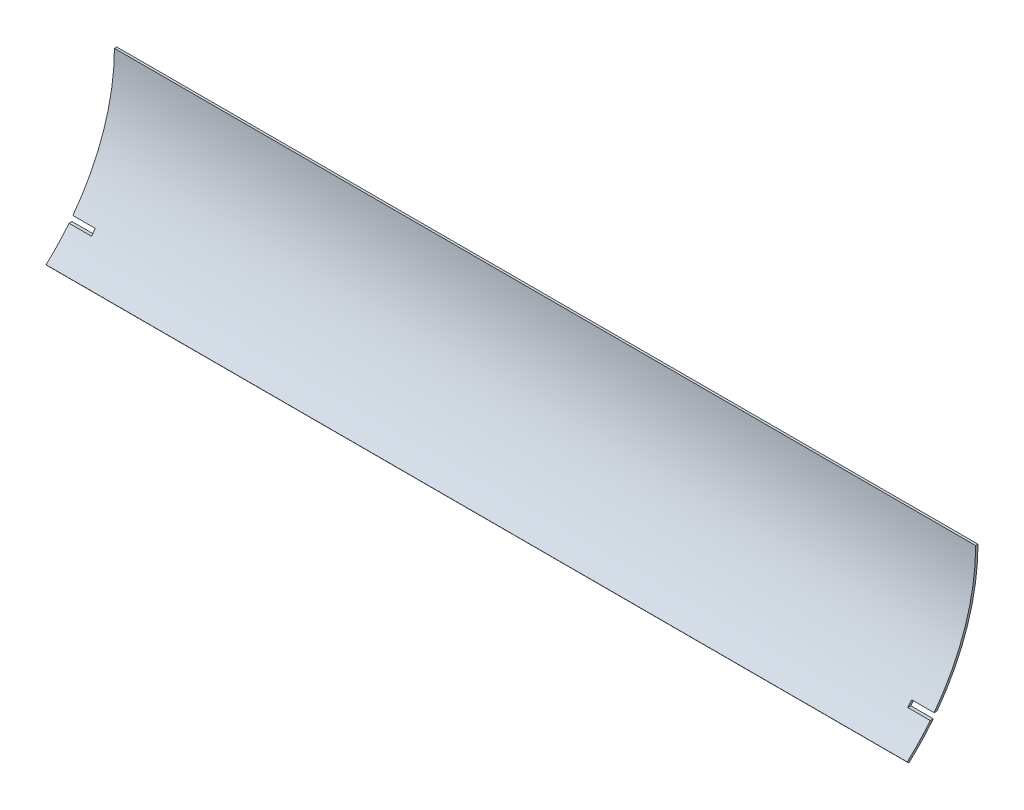
ISO-10303-21;
HEADER;
FILE_DESCRIPTION(('STEP AP214'),'2;1');
FILE_NAME('part.step','',(''),(''),'','','');
FILE_SCHEMA(('AUTOMOTIVE_DESIGN { 1 0 10303 214 1 1 1 1 }'));
ENDSEC;
DATA;
#1=APPLICATION_CONTEXT('core data for automotive mechanical design processes');
#2=APPLICATION_PROTOCOL_DEFINITION('international standard','automotive_design',2000,#1);
#3=PRODUCT_CONTEXT('',#1,'mechanical');
#4=PRODUCT('Part','Part','',(#3));
#5=PRODUCT_RELATED_PRODUCT_CATEGORY('part','',(#4));
#6=PRODUCT_DEFINITION_FORMATION('','',#4);
#7=PRODUCT_DEFINITION_CONTEXT('part definition',#1,'design');
#8=PRODUCT_DEFINITION('design','',#6,#7);
#9=PRODUCT_DEFINITION_SHAPE('','',#8);
#10=(LENGTH_UNIT() NAMED_UNIT(*) SI_UNIT(.MILLI.,.METRE.));
#11=(NAMED_UNIT(*) PLANE_ANGLE_UNIT() SI_UNIT($,.RADIAN.));
#12=(NAMED_UNIT(*) SI_UNIT($,.STERADIAN.) SOLID_ANGLE_UNIT());
#13=UNCERTAINTY_MEASURE_WITH_UNIT(LENGTH_MEASURE(1.E-05),#10,'distance_accuracy_value','');
#14=(GEOMETRIC_REPRESENTATION_CONTEXT(3) GLOBAL_UNCERTAINTY_ASSIGNED_CONTEXT((#13)) GLOBAL_UNIT_ASSIGNED_CONTEXT((#10,
#11,#12)) REPRESENTATION_CONTEXT('',''));
#15=CARTESIAN_POINT('',(0.,0.,0.));
#16=DIRECTION('',(0.,0.,1.));
#17=DIRECTION('',(1.,0.,0.));
#18=AXIS2_PLACEMENT_3D('',#15,#16,#17);
#19=CARTESIAN_POINT('',(584.2,0.,0.));
#20=DIRECTION('',(1.,0.,0.));
#21=DIRECTION('',(0.,0.,-1.));
#22=AXIS2_PLACEMENT_3D('',#19,#20,#21);
#23=PLANE('',#22);
#24=DIRECTION('',(0.,0.,1.));
#25=VECTOR('',#24,1.);
#26=CARTESIAN_POINT('',(584.2,-84.1016968085106,0.));
#27=LINE('',#26,#25);
#28=CARTESIAN_POINT('',(584.2,-84.1016968085106,-113.332381385427));
#29=VERTEX_POINT('',#28);
#30=CARTESIAN_POINT('',(584.2,-84.1016968085106,-111.349292972573));
#31=VERTEX_POINT('',#30);
#32=EDGE_CURVE('E41',#29,#31,#27,.T.);
#33=ORIENTED_EDGE('',*,*,#32,.F.);
#34=CARTESIAN_POINT('',(584.2,0.,0.));
#35=DIRECTION('',(1.,0.,0.));
#36=DIRECTION('',(0.,0.,-1.));
#37=AXIS2_PLACEMENT_3D('',#34,#35,#36);
#38=CIRCLE('',#37,141.12875);
#39=CARTESIAN_POINT('',(584.2,0.,-141.12875));
#40=VERTEX_POINT('',#39);
#41=EDGE_CURVE('E168',#29,#40,#38,.T.);
#42=ORIENTED_EDGE('',*,*,#41,.T.);
#43=DIRECTION('',(0.,0.,-1.));
#44=VECTOR('',#43,1.);
#45=CARTESIAN_POINT('',(584.2,0.,-139.54125));
#46=LINE('',#45,#44);
#47=CARTESIAN_POINT('',(584.2,0.,-139.54125));
#48=VERTEX_POINT('',#47);
#49=EDGE_CURVE('E167',#48,#40,#46,.T.);
#50=ORIENTED_EDGE('',*,*,#49,.F.);
#51=CARTESIAN_POINT('',(584.2,0.,0.));
#52=DIRECTION('',(1.,0.,0.));
#53=DIRECTION('',(0.,0.,-1.));
#54=AXIS2_PLACEMENT_3D('',#51,#52,#53);
#55=CIRCLE('',#54,139.54125);
#56=EDGE_CURVE('E171',#31,#48,#55,.T.);
#57=ORIENTED_EDGE('',*,*,#56,.F.);
#58=EDGE_LOOP('',(#33,#42,#50,#57));
#59=FACE_BOUND('',#58,.T.);
#60=ADVANCED_FACE('F33',(#59),#23,.T.);
#61=CARTESIAN_POINT('',(0.,0.,0.));
#62=DIRECTION('',(1.,0.,0.));
#63=DIRECTION('',(0.,0.,-1.));
#64=AXIS2_PLACEMENT_3D('',#61,#62,#63);
#65=PLANE('',#64);
#66=CARTESIAN_POINT('',(0.,0.,0.));
#67=DIRECTION('',(1.,0.,0.));
#68=DIRECTION('',(0.,0.,-1.));
#69=AXIS2_PLACEMENT_3D('',#66,#67,#68);
#70=CIRCLE('',#69,141.12875);
#71=CARTESIAN_POINT('',(0.,-84.1016968085106,-113.332381385427));
#72=VERTEX_POINT('',#71);
#73=CARTESIAN_POINT('',(0.,0.,-141.12875));
#74=VERTEX_POINT('',#73);
#75=EDGE_CURVE('E164',#72,#74,#70,.T.);
#76=ORIENTED_EDGE('',*,*,#75,.F.);
#77=DIRECTION('',(0.,0.,1.));
#78=VECTOR('',#77,1.);
#79=CARTESIAN_POINT('',(0.,-84.1016968085106,0.));
#80=LINE('',#79,#78);
#81=CARTESIAN_POINT('',(0.,-84.1016968085106,-111.349292972573));
#82=VERTEX_POINT('',#81);
#83=EDGE_CURVE('E203',#72,#82,#80,.T.);
#84=ORIENTED_EDGE('',*,*,#83,.T.);
#85=CARTESIAN_POINT('',(0.,0.,0.));
#86=DIRECTION('',(1.,0.,0.));
#87=DIRECTION('',(0.,0.,-1.));
#88=AXIS2_PLACEMENT_3D('',#85,#86,#87);
#89=CIRCLE('',#88,139.54125);
#90=CARTESIAN_POINT('',(0.,0.,-139.54125));
#91=VERTEX_POINT('',#90);
#92=EDGE_CURVE('E185',#82,#91,#89,.T.);
#93=ORIENTED_EDGE('',*,*,#92,.T.);
#94=DIRECTION('',(0.,0.,-1.));
#95=VECTOR('',#94,1.);
#96=CARTESIAN_POINT('',(0.,0.,-139.54125));
#97=LINE('',#96,#95);
#98=EDGE_CURVE('E182',#91,#74,#97,.T.);
#99=ORIENTED_EDGE('',*,*,#98,.T.);
#100=EDGE_LOOP('',(#76,#84,#93,#99));
#101=FACE_BOUND('',#100,.T.);
#102=ADVANCED_FACE('F227',(#101),#65,.F.);
#103=CARTESIAN_POINT('',(584.2,0.,0.));
#104=DIRECTION('',(-1.,0.,0.));
#105=DIRECTION('',(0.,0.,1.));
#106=AXIS2_PLACEMENT_3D('',#103,#104,#105);
#107=CYLINDRICAL_SURFACE('',#106,141.12875);
#108=ORIENTED_EDGE('',*,*,#41,.F.);
#109=DIRECTION('',(-1.,0.,0.));
#110=VECTOR('',#109,1.);
#111=CARTESIAN_POINT('',(584.2,-84.1016968085106,-113.332381385427));
#112=LINE('',#111,#110);
#113=CARTESIAN_POINT('',(568.96,-84.1016968085106,-113.332381385427));
#114=VERTEX_POINT('',#113);
#115=EDGE_CURVE('E142',#29,#114,#112,.T.);
#116=ORIENTED_EDGE('',*,*,#115,.T.);
#117=CARTESIAN_POINT('',(568.96,0.,0.));
#118=DIRECTION('',(-1.,0.,0.));
#119=DIRECTION('',(0.,0.,1.));
#120=AXIS2_PLACEMENT_3D('',#117,#118,#119);
#121=CIRCLE('',#120,141.12875);
#122=CARTESIAN_POINT('',(568.96,-87.4036968085106,-110.805766369664));
#123=VERTEX_POINT('',#122);
#124=EDGE_CURVE('E135',#114,#123,#121,.T.);
#125=ORIENTED_EDGE('',*,*,#124,.T.);
#126=DIRECTION('',(-1.,0.,0.));
#127=VECTOR('',#126,1.);
#128=CARTESIAN_POINT('',(584.2,-87.4036968085106,-110.805766369664));
#129=LINE('',#128,#127);
#130=CARTESIAN_POINT('',(584.2,-87.4036968085106,-110.805766369664));
#131=VERTEX_POINT('',#130);
#132=EDGE_CURVE('E121',#123,#131,#129,.F.);
#133=ORIENTED_EDGE('',*,*,#132,.T.);
#134=CARTESIAN_POINT('',(584.2,-105.095877659574,-94.1922532670615));
#135=VERTEX_POINT('',#134);
#136=EDGE_CURVE('E165',#135,#131,#38,.T.);
#137=ORIENTED_EDGE('',*,*,#136,.F.);
#138=DIRECTION('',(-1.,0.,0.));
#139=VECTOR('',#138,1.);
#140=CARTESIAN_POINT('',(584.2,-105.095877659574,-94.1922532670615));
#141=LINE('',#140,#139);
#142=CARTESIAN_POINT('',(0.,-105.095877659574,-94.1922532670615));
#143=VERTEX_POINT('',#142);
#144=EDGE_CURVE('E178',#135,#143,#141,.T.);
#145=ORIENTED_EDGE('',*,*,#144,.T.);
#146=CARTESIAN_POINT('',(0.,-87.4036968085106,-110.805766369664));
#147=VERTEX_POINT('',#146);
#148=EDGE_CURVE('E179',#143,#147,#70,.T.);
#149=ORIENTED_EDGE('',*,*,#148,.T.);
#150=DIRECTION('',(-1.,0.,0.));
#151=VECTOR('',#150,1.);
#152=CARTESIAN_POINT('',(584.2,-87.4036968085101,-110.805766369664));
#153=LINE('',#152,#151);
#154=CARTESIAN_POINT('',(15.24,-87.4036968085106,-110.805766369664));
#155=VERTEX_POINT('',#154);
#156=EDGE_CURVE('E56',#147,#155,#153,.F.);
#157=ORIENTED_EDGE('',*,*,#156,.T.);
#158=CARTESIAN_POINT('',(15.24,0.,0.));
#159=DIRECTION('',(1.,0.,0.));
#160=DIRECTION('',(0.,1.,0.));
#161=AXIS2_PLACEMENT_3D('',#158,#159,#160);
#162=CIRCLE('',#161,141.12875);
#163=CARTESIAN_POINT('',(15.24,-84.1016968085106,-113.332381385427));
#164=VERTEX_POINT('',#163);
#165=EDGE_CURVE('E161',#155,#164,#162,.T.);
#166=ORIENTED_EDGE('',*,*,#165,.T.);
#167=DIRECTION('',(-1.,0.,0.));
#168=VECTOR('',#167,1.);
#169=CARTESIAN_POINT('',(584.2,-84.1016968085106,-113.332381385427));
#170=LINE('',#169,#168);
#171=EDGE_CURVE('E158',#164,#72,#170,.T.);
#172=ORIENTED_EDGE('',*,*,#171,.T.);
#173=ORIENTED_EDGE('',*,*,#75,.T.);
#174=DIRECTION('',(-1.,0.,0.));
#175=VECTOR('',#174,1.);
#176=CARTESIAN_POINT('',(584.2,0.,-141.12875));
#177=LINE('',#176,#175);
#178=EDGE_CURVE('E198',#40,#74,#177,.T.);
#179=ORIENTED_EDGE('',*,*,#178,.F.);
#180=EDGE_LOOP('',(#108,#116,#125,#133,#137,#145,#149,#157,#166,#172,#173,#179));
#181=FACE_BOUND('',#180,.T.);
#182=ADVANCED_FACE('F35',(#181),#107,.T.);
#183=CARTESIAN_POINT('',(584.2,0.,-139.54125));
#184=DIRECTION('',(0.,1.,0.));
#185=DIRECTION('',(0.,0.,1.));
#186=AXIS2_PLACEMENT_3D('',#183,#184,#185);
#187=PLANE('',#186);
#188=ORIENTED_EDGE('',*,*,#98,.F.);
#189=DIRECTION('',(-1.,0.,0.));
#190=VECTOR('',#189,1.);
#191=CARTESIAN_POINT('',(584.2,0.,-139.54125));
#192=LINE('',#191,#190);
#193=EDGE_CURVE('E195',#48,#91,#192,.T.);
#194=ORIENTED_EDGE('',*,*,#193,.F.);
#195=ORIENTED_EDGE('',*,*,#49,.T.);
#196=ORIENTED_EDGE('',*,*,#178,.T.);
#197=EDGE_LOOP('',(#188,#194,#195,#196));
#198=FACE_BOUND('',#197,.T.);
#199=ADVANCED_FACE('F221',(#198),#187,.T.);
#200=CARTESIAN_POINT('',(584.2,0.,0.));
#201=DIRECTION('',(-1.,0.,0.));
#202=DIRECTION('',(0.,0.,1.));
#203=AXIS2_PLACEMENT_3D('',#200,#201,#202);
#204=CYLINDRICAL_SURFACE('',#203,139.54125);
#205=DIRECTION('',(-1.,0.,0.));
#206=VECTOR('',#205,1.);
#207=CARTESIAN_POINT('',(584.2,-84.1016968085106,-111.349292972573));
#208=LINE('',#207,#206);
#209=CARTESIAN_POINT('',(568.96,-84.1016968085106,-111.349292972573));
#210=VERTEX_POINT('',#209);
#211=EDGE_CURVE('E130',#31,#210,#208,.T.);
#212=ORIENTED_EDGE('',*,*,#211,.F.);
#213=ORIENTED_EDGE('',*,*,#56,.T.);
#214=ORIENTED_EDGE('',*,*,#193,.T.);
#215=ORIENTED_EDGE('',*,*,#92,.F.);
#216=DIRECTION('',(-1.,0.,0.));
#217=VECTOR('',#216,1.);
#218=CARTESIAN_POINT('',(584.2,-84.1016968085106,-111.349292972573));
#219=LINE('',#218,#217);
#220=CARTESIAN_POINT('',(15.24,-84.1016968085106,-111.349292972573));
#221=VERTEX_POINT('',#220);
#222=EDGE_CURVE('E156',#221,#82,#219,.T.);
#223=ORIENTED_EDGE('',*,*,#222,.F.);
#224=CARTESIAN_POINT('',(15.24,0.,0.));
#225=DIRECTION('',(1.,0.,0.));
#226=DIRECTION('',(0.,1.,0.));
#227=AXIS2_PLACEMENT_3D('',#224,#225,#226);
#228=CIRCLE('',#227,139.54125);
#229=CARTESIAN_POINT('',(15.24,-87.4036968085106,-108.776625410832));
#230=VERTEX_POINT('',#229);
#231=EDGE_CURVE('E206',#230,#221,#228,.T.);
#232=ORIENTED_EDGE('',*,*,#231,.F.);
#233=DIRECTION('',(-1.,0.,0.));
#234=VECTOR('',#233,1.);
#235=CARTESIAN_POINT('',(584.2,-87.4036968085101,-108.776625410832));
#236=LINE('',#235,#234);
#237=CARTESIAN_POINT('',(0.,-87.4036968085106,-108.776625410832));
#238=VERTEX_POINT('',#237);
#239=EDGE_CURVE('E152',#238,#230,#236,.F.);
#240=ORIENTED_EDGE('',*,*,#239,.F.);
#241=CARTESIAN_POINT('',(0.,-103.913696808511,-93.132722859108));
#242=VERTEX_POINT('',#241);
#243=EDGE_CURVE('E186',#242,#238,#89,.T.);
#244=ORIENTED_EDGE('',*,*,#243,.F.);
#245=DIRECTION('',(-1.,0.,0.));
#246=VECTOR('',#245,1.);
#247=CARTESIAN_POINT('',(584.2,-103.913696808511,-93.132722859108));
#248=LINE('',#247,#246);
#249=CARTESIAN_POINT('',(584.2,-103.913696808511,-93.132722859108));
#250=VERTEX_POINT('',#249);
#251=EDGE_CURVE('E193',#250,#242,#248,.T.);
#252=ORIENTED_EDGE('',*,*,#251,.F.);
#253=CARTESIAN_POINT('',(584.2,-87.4036968085106,-108.776625410832));
#254=VERTEX_POINT('',#253);
#255=EDGE_CURVE('E172',#250,#254,#55,.T.);
#256=ORIENTED_EDGE('',*,*,#255,.T.);
#257=DIRECTION('',(-1.,0.,0.));
#258=VECTOR('',#257,1.);
#259=CARTESIAN_POINT('',(584.2,-87.4036968085106,-108.776625410832));
#260=LINE('',#259,#258);
#261=CARTESIAN_POINT('',(568.96,-87.4036968085106,-108.776625410832));
#262=VERTEX_POINT('',#261);
#263=EDGE_CURVE('E48',#262,#254,#260,.F.);
#264=ORIENTED_EDGE('',*,*,#263,.F.);
#265=CARTESIAN_POINT('',(568.96,0.,0.));
#266=DIRECTION('',(-1.,0.,0.));
#267=DIRECTION('',(0.,0.,1.));
#268=AXIS2_PLACEMENT_3D('',#265,#266,#267);
#269=CIRCLE('',#268,139.54125);
#270=EDGE_CURVE('E11',#210,#262,#269,.T.);
#271=ORIENTED_EDGE('',*,*,#270,.F.);
#272=EDGE_LOOP('',(#212,#213,#214,#215,#223,#232,#240,#244,#252,#256,#264,#271));
#273=FACE_BOUND('',#272,.T.);
#274=ADVANCED_FACE('F215',(#273),#204,.F.);
#275=CARTESIAN_POINT('',(584.2,-105.095877659574,-94.1922532670615));
#276=DIRECTION('',(0.,-0.667420729419495,0.74468085106383));
#277=DIRECTION('',(0.,-0.74468085106383,-0.667420729419495));
#278=AXIS2_PLACEMENT_3D('',#275,#276,#277);
#279=PLANE('',#278);
#280=DIRECTION('',(0.,0.74468085106383,0.667420729419495));
#281=VECTOR('',#280,1.);
#282=CARTESIAN_POINT('',(0.,-105.095877659574,-94.1922532670615));
#283=LINE('',#282,#281);
#284=EDGE_CURVE('E189',#143,#242,#283,.T.);
#285=ORIENTED_EDGE('',*,*,#284,.F.);
#286=ORIENTED_EDGE('',*,*,#144,.F.);
#287=DIRECTION('',(0.,0.74468085106383,0.667420729419495));
#288=VECTOR('',#287,1.);
#289=CARTESIAN_POINT('',(584.2,-105.095877659574,-94.1922532670615));
#290=LINE('',#289,#288);
#291=EDGE_CURVE('E175',#135,#250,#290,.T.);
#292=ORIENTED_EDGE('',*,*,#291,.T.);
#293=ORIENTED_EDGE('',*,*,#251,.T.);
#294=EDGE_LOOP('',(#285,#286,#292,#293));
#295=FACE_BOUND('',#294,.T.);
#296=ADVANCED_FACE('F241',(#295),#279,.T.);
#297=DIRECTION('',(0.,0.,-1.));
#298=VECTOR('',#297,1.);
#299=CARTESIAN_POINT('',(584.2,-87.4036968085106,0.));
#300=LINE('',#299,#298);
#301=EDGE_CURVE('E125',#254,#131,#300,.T.);
#302=ORIENTED_EDGE('',*,*,#301,.F.);
#303=ORIENTED_EDGE('',*,*,#255,.F.);
#304=ORIENTED_EDGE('',*,*,#291,.F.);
#305=ORIENTED_EDGE('',*,*,#136,.T.);
#306=EDGE_LOOP('',(#302,#303,#304,#305));
#307=FACE_BOUND('',#306,.T.);
#308=ADVANCED_FACE('F245',(#307),#23,.T.);
#309=ORIENTED_EDGE('',*,*,#243,.T.);
#310=DIRECTION('',(0.,0.,-1.));
#311=VECTOR('',#310,1.);
#312=CARTESIAN_POINT('',(0.,-87.4036968085106,0.));
#313=LINE('',#312,#311);
#314=EDGE_CURVE('E201',#238,#147,#313,.T.);
#315=ORIENTED_EDGE('',*,*,#314,.T.);
#316=ORIENTED_EDGE('',*,*,#148,.F.);
#317=ORIENTED_EDGE('',*,*,#284,.T.);
#318=EDGE_LOOP('',(#309,#315,#316,#317));
#319=FACE_BOUND('',#318,.T.);
#320=ADVANCED_FACE('F237',(#319),#65,.F.);
#321=CARTESIAN_POINT('',(15.24,-87.4036968085106,-141.12875));
#322=DIRECTION('',(1.,0.,0.));
#323=DIRECTION('',(0.,1.,0.));
#324=AXIS2_PLACEMENT_3D('',#321,#322,#323);
#325=PLANE('',#324);
#326=DIRECTION('',(0.,0.,1.));
#327=VECTOR('',#326,1.);
#328=CARTESIAN_POINT('',(15.24,-87.4036968085106,-141.12875));
#329=LINE('',#328,#327);
#330=EDGE_CURVE('E143',#155,#230,#329,.T.);
#331=ORIENTED_EDGE('',*,*,#330,.T.);
#332=ORIENTED_EDGE('',*,*,#231,.T.);
#333=DIRECTION('',(0.,0.,1.));
#334=VECTOR('',#333,1.);
#335=CARTESIAN_POINT('',(15.24,-84.1016968085106,-141.12875));
#336=LINE('',#335,#334);
#337=EDGE_CURVE('E146',#164,#221,#336,.T.);
#338=ORIENTED_EDGE('',*,*,#337,.F.);
#339=ORIENTED_EDGE('',*,*,#165,.F.);
#340=EDGE_LOOP('',(#331,#332,#338,#339));
#341=FACE_BOUND('',#340,.T.);
#342=ADVANCED_FACE('F232',(#341),#325,.F.);
#343=CARTESIAN_POINT('',(15.24,-84.1016968085106,-141.12875));
#344=DIRECTION('',(0.,1.,0.));
#345=DIRECTION('',(0.,0.,1.));
#346=AXIS2_PLACEMENT_3D('',#343,#344,#345);
#347=PLANE('',#346);
#348=ORIENTED_EDGE('',*,*,#337,.T.);
#349=ORIENTED_EDGE('',*,*,#222,.T.);
#350=ORIENTED_EDGE('',*,*,#83,.F.);
#351=ORIENTED_EDGE('',*,*,#171,.F.);
#352=EDGE_LOOP('',(#348,#349,#350,#351));
#353=FACE_BOUND('',#352,.T.);
#354=ADVANCED_FACE('F229',(#353),#347,.F.);
#355=CARTESIAN_POINT('',(0.,-87.4036968085106,-141.12875));
#356=DIRECTION('',(0.,-1.,0.));
#357=DIRECTION('',(1.,0.,0.));
#358=AXIS2_PLACEMENT_3D('',#355,#356,#357);
#359=PLANE('',#358);
#360=ORIENTED_EDGE('',*,*,#314,.F.);
#361=ORIENTED_EDGE('',*,*,#239,.T.);
#362=ORIENTED_EDGE('',*,*,#330,.F.);
#363=ORIENTED_EDGE('',*,*,#156,.F.);
#364=EDGE_LOOP('',(#360,#361,#362,#363));
#365=FACE_BOUND('',#364,.T.);
#366=ADVANCED_FACE('F233',(#365),#359,.F.);
#367=CARTESIAN_POINT('',(568.96,-87.4036968085106,-141.12875));
#368=DIRECTION('',(-1.,0.,0.));
#369=DIRECTION('',(0.,0.,1.));
#370=AXIS2_PLACEMENT_3D('',#367,#368,#369);
#371=PLANE('',#370);
#372=DIRECTION('',(0.,0.,1.));
#373=VECTOR('',#372,1.);
#374=CARTESIAN_POINT('',(568.96,-84.1016968085106,-141.12875));
#375=LINE('',#374,#373);
#376=EDGE_CURVE('E138',#114,#210,#375,.T.);
#377=ORIENTED_EDGE('',*,*,#376,.T.);
#378=ORIENTED_EDGE('',*,*,#270,.T.);
#379=DIRECTION('',(0.,0.,1.));
#380=VECTOR('',#379,1.);
#381=CARTESIAN_POINT('',(568.96,-87.4036968085106,-141.12875));
#382=LINE('',#381,#380);
#383=EDGE_CURVE('E124',#123,#262,#382,.T.);
#384=ORIENTED_EDGE('',*,*,#383,.F.);
#385=ORIENTED_EDGE('',*,*,#124,.F.);
#386=EDGE_LOOP('',(#377,#378,#384,#385));
#387=FACE_BOUND('',#386,.T.);
#388=ADVANCED_FACE('F134',(#387),#371,.F.);
#389=CARTESIAN_POINT('',(568.96,-84.1016968085106,-141.12875));
#390=DIRECTION('',(0.,1.,0.));
#391=DIRECTION('',(0.,0.,1.));
#392=AXIS2_PLACEMENT_3D('',#389,#390,#391);
#393=PLANE('',#392);
#394=ORIENTED_EDGE('',*,*,#32,.T.);
#395=ORIENTED_EDGE('',*,*,#211,.T.);
#396=ORIENTED_EDGE('',*,*,#376,.F.);
#397=ORIENTED_EDGE('',*,*,#115,.F.);
#398=EDGE_LOOP('',(#394,#395,#396,#397));
#399=FACE_BOUND('',#398,.T.);
#400=ADVANCED_FACE('F211',(#399),#393,.F.);
#401=CARTESIAN_POINT('',(584.2,-87.4036968085106,-141.12875));
#402=DIRECTION('',(0.,-1.,0.));
#403=DIRECTION('',(1.,0.,0.));
#404=AXIS2_PLACEMENT_3D('',#401,#402,#403);
#405=PLANE('',#404);
#406=ORIENTED_EDGE('',*,*,#383,.T.);
#407=ORIENTED_EDGE('',*,*,#263,.T.);
#408=ORIENTED_EDGE('',*,*,#301,.T.);
#409=ORIENTED_EDGE('',*,*,#132,.F.);
#410=EDGE_LOOP('',(#406,#407,#408,#409));
#411=FACE_BOUND('',#410,.T.);
#412=ADVANCED_FACE('F123',(#411),#405,.F.);
#413=CLOSED_SHELL('',(#60,#102,#182,#199,#274,#296,#308,#320,#342,#354,#366,#388,#400,#412));
#414=MANIFOLD_SOLID_BREP('B2',#413);
#415=ADVANCED_BREP_SHAPE_REPRESENTATION('',(#18,#414),#14);
#416=SHAPE_DEFINITION_REPRESENTATION(#9,#415);
ENDSEC;
END-ISO-10303-21;
